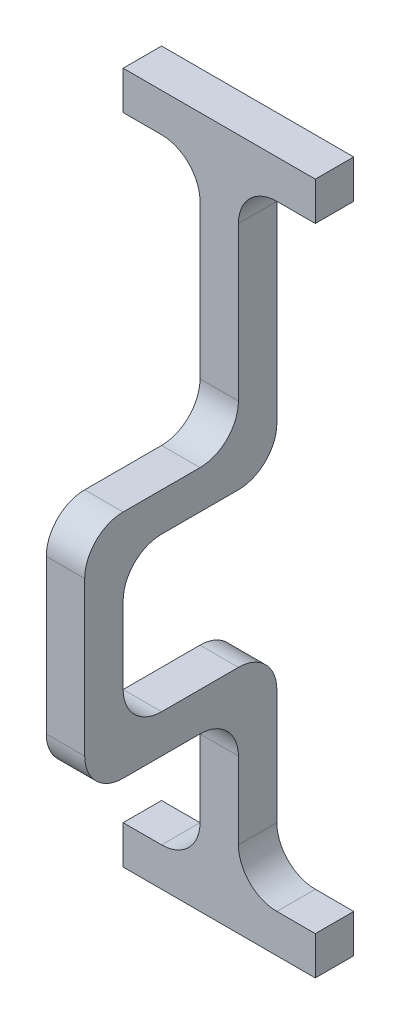
ISO-10303-21;
HEADER;
FILE_DESCRIPTION(('STEP AP214'),'2;1');
FILE_NAME('part.step','',(''),(''),'','','');
FILE_SCHEMA(('AUTOMOTIVE_DESIGN { 1 0 10303 214 1 1 1 1 }'));
ENDSEC;
DATA;
#1=APPLICATION_CONTEXT('core data for automotive mechanical design processes');
#2=APPLICATION_PROTOCOL_DEFINITION('international standard','automotive_design',2000,#1);
#3=PRODUCT_CONTEXT('',#1,'mechanical');
#4=PRODUCT('Part','Part','',(#3));
#5=PRODUCT_RELATED_PRODUCT_CATEGORY('part','',(#4));
#6=PRODUCT_DEFINITION_FORMATION('','',#4);
#7=PRODUCT_DEFINITION_CONTEXT('part definition',#1,'design');
#8=PRODUCT_DEFINITION('design','',#6,#7);
#9=PRODUCT_DEFINITION_SHAPE('','',#8);
#10=(LENGTH_UNIT() NAMED_UNIT(*) SI_UNIT(.MILLI.,.METRE.));
#11=(NAMED_UNIT(*) PLANE_ANGLE_UNIT() SI_UNIT($,.RADIAN.));
#12=(NAMED_UNIT(*) SI_UNIT($,.STERADIAN.) SOLID_ANGLE_UNIT());
#13=UNCERTAINTY_MEASURE_WITH_UNIT(LENGTH_MEASURE(1.E-05),#10,'distance_accuracy_value','');
#14=(GEOMETRIC_REPRESENTATION_CONTEXT(3) GLOBAL_UNCERTAINTY_ASSIGNED_CONTEXT((#13)) GLOBAL_UNIT_ASSIGNED_CONTEXT((#10,
#11,#12)) REPRESENTATION_CONTEXT('',''));
#15=CARTESIAN_POINT('',(0.,0.,0.));
#16=DIRECTION('',(0.,0.,1.));
#17=DIRECTION('',(1.,0.,0.));
#18=AXIS2_PLACEMENT_3D('',#15,#16,#17);
#19=CARTESIAN_POINT('',(10.,0.,0.));
#20=DIRECTION('',(1.,0.,0.));
#21=DIRECTION('',(0.,0.,-1.));
#22=AXIS2_PLACEMENT_3D('',#19,#20,#21);
#23=PLANE('',#22);
#24=DIRECTION('',(0.,-1.,0.));
#25=VECTOR('',#24,1.);
#26=CARTESIAN_POINT('',(10.,-50.,9.99999999999998));
#27=LINE('',#26,#25);
#28=CARTESIAN_POINT('',(10.,-60.,9.99999999999998));
#29=VERTEX_POINT('',#28);
#30=CARTESIAN_POINT('',(10.,-80.,9.99999999999998));
#31=VERTEX_POINT('',#30);
#32=EDGE_CURVE('E458',#29,#31,#27,.T.);
#33=ORIENTED_EDGE('',*,*,#32,.T.);
#34=DIRECTION('',(0.,0.,1.));
#35=VECTOR('',#34,1.);
#36=CARTESIAN_POINT('',(10.,-80.,0.));
#37=LINE('',#36,#35);
#38=CARTESIAN_POINT('',(10.,-80.,0.));
#39=VERTEX_POINT('',#38);
#40=EDGE_CURVE('E340',#31,#39,#37,.F.);
#41=ORIENTED_EDGE('',*,*,#40,.T.);
#42=DIRECTION('',(0.,1.,0.));
#43=VECTOR('',#42,1.);
#44=CARTESIAN_POINT('',(10.,-100.,0.));
#45=LINE('',#44,#43);
#46=CARTESIAN_POINT('',(10.,-50.,0.));
#47=VERTEX_POINT('',#46);
#48=EDGE_CURVE('E462',#39,#47,#45,.T.);
#49=ORIENTED_EDGE('',*,*,#48,.T.);
#50=CARTESIAN_POINT('',(10.,-50.,10.));
#51=DIRECTION('',(1.,0.,0.));
#52=DIRECTION('',(0.,0.,-1.));
#53=AXIS2_PLACEMENT_3D('',#50,#51,#52);
#54=CIRCLE('',#53,10.);
#55=CARTESIAN_POINT('',(10.,-40.,10.));
#56=VERTEX_POINT('',#55);
#57=EDGE_CURVE('E338',#47,#56,#54,.T.);
#58=ORIENTED_EDGE('',*,*,#57,.T.);
#59=DIRECTION('',(0.,0.,1.));
#60=VECTOR('',#59,1.);
#61=CARTESIAN_POINT('',(10.,-40.,0.));
#62=LINE('',#61,#60);
#63=CARTESIAN_POINT('',(10.,-40.,30.));
#64=VERTEX_POINT('',#63);
#65=EDGE_CURVE('E465',#56,#64,#62,.T.);
#66=ORIENTED_EDGE('',*,*,#65,.T.);
#67=CARTESIAN_POINT('',(10.,-30.,30.));
#68=DIRECTION('',(1.,0.,0.));
#69=DIRECTION('',(0.,0.,-1.));
#70=AXIS2_PLACEMENT_3D('',#67,#68,#69);
#71=CIRCLE('',#70,10.);
#72=CARTESIAN_POINT('',(10.,-30.,40.));
#73=VERTEX_POINT('',#72);
#74=EDGE_CURVE('E472',#64,#73,#71,.F.);
#75=ORIENTED_EDGE('',*,*,#74,.T.);
#76=DIRECTION('',(0.,1.,0.));
#77=VECTOR('',#76,1.);
#78=CARTESIAN_POINT('',(10.,-40.,40.));
#79=LINE('',#78,#77);
#80=CARTESIAN_POINT('',(10.,-10.,40.));
#81=VERTEX_POINT('',#80);
#82=EDGE_CURVE('E422',#73,#81,#79,.T.);
#83=ORIENTED_EDGE('',*,*,#82,.T.);
#84=CARTESIAN_POINT('',(10.,-10.,30.));
#85=DIRECTION('',(1.,0.,0.));
#86=DIRECTION('',(0.,0.,-1.));
#87=AXIS2_PLACEMENT_3D('',#84,#85,#86);
#88=CIRCLE('',#87,10.);
#89=CARTESIAN_POINT('',(10.,0.,30.));
#90=VERTEX_POINT('',#89);
#91=EDGE_CURVE('E11',#81,#90,#88,.F.);
#92=ORIENTED_EDGE('',*,*,#91,.T.);
#93=DIRECTION('',(0.,0.,-1.));
#94=VECTOR('',#93,1.);
#95=CARTESIAN_POINT('',(10.,0.,40.));
#96=LINE('',#95,#94);
#97=CARTESIAN_POINT('',(10.,0.,10.));
#98=VERTEX_POINT('',#97);
#99=EDGE_CURVE('E314',#90,#98,#96,.T.);
#100=ORIENTED_EDGE('',*,*,#99,.T.);
#101=CARTESIAN_POINT('',(10.,10.,10.));
#102=DIRECTION('',(1.,0.,0.));
#103=DIRECTION('',(0.,0.,-1.));
#104=AXIS2_PLACEMENT_3D('',#101,#102,#103);
#105=CIRCLE('',#104,10.);
#106=CARTESIAN_POINT('',(10.,10.,0.));
#107=VERTEX_POINT('',#106);
#108=EDGE_CURVE('E336',#98,#107,#105,.T.);
#109=ORIENTED_EDGE('',*,*,#108,.T.);
#110=DIRECTION('',(0.,1.,0.));
#111=VECTOR('',#110,1.);
#112=CARTESIAN_POINT('',(10.,0.,0.));
#113=LINE('',#112,#111);
#114=CARTESIAN_POINT('',(10.,60.,0.));
#115=VERTEX_POINT('',#114);
#116=EDGE_CURVE('E317',#107,#115,#113,.T.);
#117=ORIENTED_EDGE('',*,*,#116,.T.);
#118=DIRECTION('',(0.,0.,-1.));
#119=VECTOR('',#118,1.);
#120=CARTESIAN_POINT('',(10.,60.,0.));
#121=LINE('',#120,#119);
#122=CARTESIAN_POINT('',(10.,60.,10.));
#123=VERTEX_POINT('',#122);
#124=EDGE_CURVE('E334',#115,#123,#121,.F.);
#125=ORIENTED_EDGE('',*,*,#124,.T.);
#126=DIRECTION('',(0.,-1.,0.));
#127=VECTOR('',#126,1.);
#128=CARTESIAN_POINT('',(10.,80.,10.));
#129=LINE('',#128,#127);
#130=CARTESIAN_POINT('',(10.,20.,9.99999999999999));
#131=VERTEX_POINT('',#130);
#132=EDGE_CURVE('E327',#123,#131,#129,.T.);
#133=ORIENTED_EDGE('',*,*,#132,.T.);
#134=CARTESIAN_POINT('',(10.,20.,20.));
#135=DIRECTION('',(1.,0.,0.));
#136=DIRECTION('',(0.,0.,-1.));
#137=AXIS2_PLACEMENT_3D('',#134,#135,#136);
#138=CIRCLE('',#137,10.);
#139=CARTESIAN_POINT('',(10.,9.99999999999999,20.));
#140=VERTEX_POINT('',#139);
#141=EDGE_CURVE('E503',#131,#140,#138,.F.);
#142=ORIENTED_EDGE('',*,*,#141,.T.);
#143=DIRECTION('',(0.,0.,1.));
#144=VECTOR('',#143,1.);
#145=CARTESIAN_POINT('',(10.,9.99999999999999,9.99999999999999));
#146=LINE('',#145,#144);
#147=CARTESIAN_POINT('',(10.,9.99999999999999,40.));
#148=VERTEX_POINT('',#147);
#149=EDGE_CURVE('E374',#140,#148,#146,.T.);
#150=ORIENTED_EDGE('',*,*,#149,.T.);
#151=CARTESIAN_POINT('',(10.,0.,40.));
#152=DIRECTION('',(1.,0.,0.));
#153=DIRECTION('',(0.,0.,-1.));
#154=AXIS2_PLACEMENT_3D('',#151,#152,#153);
#155=CIRCLE('',#154,10.);
#156=CARTESIAN_POINT('',(10.,0.,50.));
#157=VERTEX_POINT('',#156);
#158=EDGE_CURVE('E330',#148,#157,#155,.T.);
#159=ORIENTED_EDGE('',*,*,#158,.T.);
#160=DIRECTION('',(0.,-1.,0.));
#161=VECTOR('',#160,1.);
#162=CARTESIAN_POINT('',(10.,9.99999999999999,50.));
#163=LINE('',#162,#161);
#164=CARTESIAN_POINT('',(10.,-40.,50.));
#165=VERTEX_POINT('',#164);
#166=EDGE_CURVE('E451',#157,#165,#163,.T.);
#167=ORIENTED_EDGE('',*,*,#166,.T.);
#168=CARTESIAN_POINT('',(10.,-40.,40.));
#169=DIRECTION('',(1.,0.,0.));
#170=DIRECTION('',(0.,0.,-1.));
#171=AXIS2_PLACEMENT_3D('',#168,#169,#170);
#172=CIRCLE('',#171,10.);
#173=CARTESIAN_POINT('',(10.,-50.,40.));
#174=VERTEX_POINT('',#173);
#175=EDGE_CURVE('E332',#165,#174,#172,.T.);
#176=ORIENTED_EDGE('',*,*,#175,.T.);
#177=DIRECTION('',(0.,0.,-1.));
#178=VECTOR('',#177,1.);
#179=CARTESIAN_POINT('',(10.,-50.,50.));
#180=LINE('',#179,#178);
#181=CARTESIAN_POINT('',(10.,-50.,20.));
#182=VERTEX_POINT('',#181);
#183=EDGE_CURVE('E455',#174,#182,#180,.T.);
#184=ORIENTED_EDGE('',*,*,#183,.T.);
#185=CARTESIAN_POINT('',(10.,-60.,20.));
#186=DIRECTION('',(1.,0.,0.));
#187=DIRECTION('',(0.,0.,-1.));
#188=AXIS2_PLACEMENT_3D('',#185,#186,#187);
#189=CIRCLE('',#188,10.);
#190=EDGE_CURVE('E499',#182,#29,#189,.F.);
#191=ORIENTED_EDGE('',*,*,#190,.T.);
#192=EDGE_LOOP('',(#33,#41,#49,#58,#66,#75,#83,#92,#100,#109,#117,#125,#133,#142,#150,#159,#167,
#176,#184,#191));
#193=FACE_BOUND('',#192,.T.);
#194=ADVANCED_FACE('F33',(#193),#23,.T.);
#195=CARTESIAN_POINT('',(10.,0.,40.));
#196=DIRECTION('',(0.,1.,0.));
#197=DIRECTION('',(0.,0.,1.));
#198=AXIS2_PLACEMENT_3D('',#195,#196,#197);
#199=PLANE('',#198);
#200=DIRECTION('',(0.,0.,-1.));
#201=VECTOR('',#200,1.);
#202=CARTESIAN_POINT('',(0.,0.,40.));
#203=LINE('',#202,#201);
#204=CARTESIAN_POINT('',(0.,0.,30.));
#205=VERTEX_POINT('',#204);
#206=CARTESIAN_POINT('',(0.,0.,10.));
#207=VERTEX_POINT('',#206);
#208=EDGE_CURVE('E357',#205,#207,#203,.T.);
#209=ORIENTED_EDGE('',*,*,#208,.T.);
#210=DIRECTION('',(-1.,0.,0.));
#211=VECTOR('',#210,1.);
#212=CARTESIAN_POINT('',(10.,0.,10.));
#213=LINE('',#212,#211);
#214=EDGE_CURVE('E484',#207,#98,#213,.F.);
#215=ORIENTED_EDGE('',*,*,#214,.T.);
#216=ORIENTED_EDGE('',*,*,#99,.F.);
#217=DIRECTION('',(-1.,0.,0.));
#218=VECTOR('',#217,1.);
#219=CARTESIAN_POINT('',(0.,0.,30.));
#220=LINE('',#219,#218);
#221=EDGE_CURVE('E480',#90,#205,#220,.T.);
#222=ORIENTED_EDGE('',*,*,#221,.T.);
#223=EDGE_LOOP('',(#209,#215,#216,#222));
#224=FACE_BOUND('',#223,.T.);
#225=ADVANCED_FACE('F594',(#224),#199,.F.);
#226=CARTESIAN_POINT('',(10.,0.,0.));
#227=DIRECTION('',(0.,0.,1.));
#228=DIRECTION('',(1.,0.,0.));
#229=AXIS2_PLACEMENT_3D('',#226,#227,#228);
#230=PLANE('',#229);
#231=ORIENTED_EDGE('',*,*,#116,.F.);
#232=DIRECTION('',(-1.,0.,0.));
#233=VECTOR('',#232,1.);
#234=CARTESIAN_POINT('',(10.,10.,0.));
#235=LINE('',#234,#233);
#236=CARTESIAN_POINT('',(0.,10.,0.));
#237=VERTEX_POINT('',#236);
#238=EDGE_CURVE('E485',#107,#237,#235,.T.);
#239=ORIENTED_EDGE('',*,*,#238,.T.);
#240=DIRECTION('',(0.,1.,0.));
#241=VECTOR('',#240,1.);
#242=CARTESIAN_POINT('',(0.,0.,0.));
#243=LINE('',#242,#241);
#244=CARTESIAN_POINT('',(0.,60.,0.));
#245=VERTEX_POINT('',#244);
#246=EDGE_CURVE('E353',#237,#245,#243,.T.);
#247=ORIENTED_EDGE('',*,*,#246,.T.);
#248=CARTESIAN_POINT('',(-10.,60.,0.));
#249=DIRECTION('',(0.,0.,1.));
#250=DIRECTION('',(1.,0.,0.));
#251=AXIS2_PLACEMENT_3D('',#248,#249,#250);
#252=CIRCLE('',#251,10.);
#253=CARTESIAN_POINT('',(-10.,70.,0.));
#254=VERTEX_POINT('',#253);
#255=EDGE_CURVE('E56',#245,#254,#252,.T.);
#256=ORIENTED_EDGE('',*,*,#255,.T.);
#257=DIRECTION('',(1.,0.,0.));
#258=VECTOR('',#257,1.);
#259=CARTESIAN_POINT('',(-20.,70.,0.));
#260=LINE('',#259,#258);
#261=CARTESIAN_POINT('',(-20.,70.,0.));
#262=VERTEX_POINT('',#261);
#263=EDGE_CURVE('E289',#262,#254,#260,.T.);
#264=ORIENTED_EDGE('',*,*,#263,.F.);
#265=DIRECTION('',(0.,1.,0.));
#266=VECTOR('',#265,1.);
#267=CARTESIAN_POINT('',(-20.,80.,0.));
#268=LINE('',#267,#266);
#269=CARTESIAN_POINT('',(-20.,80.,0.));
#270=VERTEX_POINT('',#269);
#271=EDGE_CURVE('E278',#262,#270,#268,.T.);
#272=ORIENTED_EDGE('',*,*,#271,.T.);
#273=DIRECTION('',(-1.,0.,0.));
#274=VECTOR('',#273,1.);
#275=CARTESIAN_POINT('',(10.,80.,0.));
#276=LINE('',#275,#274);
#277=CARTESIAN_POINT('',(30.,80.,0.));
#278=VERTEX_POINT('',#277);
#279=EDGE_CURVE('E398',#278,#270,#276,.T.);
#280=ORIENTED_EDGE('',*,*,#279,.F.);
#281=DIRECTION('',(0.,1.,0.));
#282=VECTOR('',#281,1.);
#283=CARTESIAN_POINT('',(30.,80.,0.));
#284=LINE('',#283,#282);
#285=CARTESIAN_POINT('',(30.,70.,0.));
#286=VERTEX_POINT('',#285);
#287=EDGE_CURVE('E307',#286,#278,#284,.T.);
#288=ORIENTED_EDGE('',*,*,#287,.F.);
#289=DIRECTION('',(-1.,0.,0.));
#290=VECTOR('',#289,1.);
#291=CARTESIAN_POINT('',(30.,70.,0.));
#292=LINE('',#291,#290);
#293=CARTESIAN_POINT('',(20.,70.,0.));
#294=VERTEX_POINT('',#293);
#295=EDGE_CURVE('E313',#286,#294,#292,.T.);
#296=ORIENTED_EDGE('',*,*,#295,.T.);
#297=CARTESIAN_POINT('',(20.,60.,0.));
#298=DIRECTION('',(0.,0.,1.));
#299=DIRECTION('',(1.,0.,0.));
#300=AXIS2_PLACEMENT_3D('',#297,#298,#299);
#301=CIRCLE('',#300,10.);
#302=EDGE_CURVE('E48',#294,#115,#301,.T.);
#303=ORIENTED_EDGE('',*,*,#302,.T.);
#304=EDGE_LOOP('',(#231,#239,#247,#256,#264,#272,#280,#288,#296,#303));
#305=FACE_BOUND('',#304,.T.);
#306=ADVANCED_FACE('F599',(#305),#230,.F.);
#307=CARTESIAN_POINT('',(10.,80.,0.));
#308=DIRECTION('',(0.,-1.,0.));
#309=DIRECTION('',(0.,0.,-1.));
#310=AXIS2_PLACEMENT_3D('',#307,#308,#309);
#311=PLANE('',#310);
#312=ORIENTED_EDGE('',*,*,#279,.T.);
#313=DIRECTION('',(0.,0.,1.));
#314=VECTOR('',#313,1.);
#315=CARTESIAN_POINT('',(-20.,80.,10.));
#316=LINE('',#315,#314);
#317=CARTESIAN_POINT('',(-20.,80.,10.));
#318=VERTEX_POINT('',#317);
#319=EDGE_CURVE('E275',#270,#318,#316,.T.);
#320=ORIENTED_EDGE('',*,*,#319,.T.);
#321=DIRECTION('',(-1.,0.,0.));
#322=VECTOR('',#321,1.);
#323=CARTESIAN_POINT('',(10.,80.,10.));
#324=LINE('',#323,#322);
#325=CARTESIAN_POINT('',(30.,80.,10.));
#326=VERTEX_POINT('',#325);
#327=EDGE_CURVE('E416',#326,#318,#324,.T.);
#328=ORIENTED_EDGE('',*,*,#327,.F.);
#329=DIRECTION('',(0.,0.,1.));
#330=VECTOR('',#329,1.);
#331=CARTESIAN_POINT('',(30.,80.,10.));
#332=LINE('',#331,#330);
#333=EDGE_CURVE('E310',#278,#326,#332,.T.);
#334=ORIENTED_EDGE('',*,*,#333,.F.);
#335=EDGE_LOOP('',(#312,#320,#328,#334));
#336=FACE_BOUND('',#335,.T.);
#337=ADVANCED_FACE('F626',(#336),#311,.F.);
#338=CARTESIAN_POINT('',(10.,80.,10.));
#339=DIRECTION('',(0.,0.,-1.));
#340=DIRECTION('',(0.,1.,0.));
#341=AXIS2_PLACEMENT_3D('',#338,#339,#340);
#342=PLANE('',#341);
#343=DIRECTION('',(0.,-1.,0.));
#344=VECTOR('',#343,1.);
#345=CARTESIAN_POINT('',(0.,80.,10.));
#346=LINE('',#345,#344);
#347=CARTESIAN_POINT('',(0.,60.,10.));
#348=VERTEX_POINT('',#347);
#349=CARTESIAN_POINT('',(0.,20.,9.99999999999999));
#350=VERTEX_POINT('',#349);
#351=EDGE_CURVE('E356',#348,#350,#346,.T.);
#352=ORIENTED_EDGE('',*,*,#351,.T.);
#353=DIRECTION('',(-1.,0.,0.));
#354=VECTOR('',#353,1.);
#355=CARTESIAN_POINT('',(10.,20.,9.99999999999999));
#356=LINE('',#355,#354);
#357=EDGE_CURVE('E375',#350,#131,#356,.F.);
#358=ORIENTED_EDGE('',*,*,#357,.T.);
#359=ORIENTED_EDGE('',*,*,#132,.F.);
#360=CARTESIAN_POINT('',(20.,60.,10.));
#361=DIRECTION('',(0.,0.,-1.));
#362=DIRECTION('',(0.,1.,0.));
#363=AXIS2_PLACEMENT_3D('',#360,#361,#362);
#364=CIRCLE('',#363,10.);
#365=CARTESIAN_POINT('',(20.,70.,10.));
#366=VERTEX_POINT('',#365);
#367=EDGE_CURVE('E519',#123,#366,#364,.T.);
#368=ORIENTED_EDGE('',*,*,#367,.T.);
#369=DIRECTION('',(-1.,0.,0.));
#370=VECTOR('',#369,1.);
#371=CARTESIAN_POINT('',(30.,70.,10.));
#372=LINE('',#371,#370);
#373=CARTESIAN_POINT('',(30.,70.,10.));
#374=VERTEX_POINT('',#373);
#375=EDGE_CURVE('E408',#374,#366,#372,.T.);
#376=ORIENTED_EDGE('',*,*,#375,.F.);
#377=DIRECTION('',(0.,-1.,0.));
#378=VECTOR('',#377,1.);
#379=CARTESIAN_POINT('',(30.,80.,10.));
#380=LINE('',#379,#378);
#381=EDGE_CURVE('E302',#326,#374,#380,.T.);
#382=ORIENTED_EDGE('',*,*,#381,.F.);
#383=ORIENTED_EDGE('',*,*,#327,.T.);
#384=DIRECTION('',(0.,-1.,0.));
#385=VECTOR('',#384,1.);
#386=CARTESIAN_POINT('',(-20.,80.,10.));
#387=LINE('',#386,#385);
#388=CARTESIAN_POINT('',(-20.,70.,10.));
#389=VERTEX_POINT('',#388);
#390=EDGE_CURVE('E253',#318,#389,#387,.T.);
#391=ORIENTED_EDGE('',*,*,#390,.T.);
#392=DIRECTION('',(1.,0.,0.));
#393=VECTOR('',#392,1.);
#394=CARTESIAN_POINT('',(-20.,70.,10.));
#395=LINE('',#394,#393);
#396=CARTESIAN_POINT('',(-10.,70.,10.));
#397=VERTEX_POINT('',#396);
#398=EDGE_CURVE('E284',#389,#397,#395,.T.);
#399=ORIENTED_EDGE('',*,*,#398,.T.);
#400=CARTESIAN_POINT('',(-10.,60.,10.));
#401=DIRECTION('',(0.,0.,-1.));
#402=DIRECTION('',(0.,1.,0.));
#403=AXIS2_PLACEMENT_3D('',#400,#401,#402);
#404=CIRCLE('',#403,10.);
#405=EDGE_CURVE('E516',#397,#348,#404,.T.);
#406=ORIENTED_EDGE('',*,*,#405,.T.);
#407=EDGE_LOOP('',(#352,#358,#359,#368,#376,#382,#383,#391,#399,#406));
#408=FACE_BOUND('',#407,.T.);
#409=ADVANCED_FACE('F623',(#408),#342,.F.);
#410=CARTESIAN_POINT('',(10.,9.99999999999999,9.99999999999999));
#411=DIRECTION('',(0.,-1.,0.));
#412=DIRECTION('',(0.,0.,-1.));
#413=AXIS2_PLACEMENT_3D('',#410,#411,#412);
#414=PLANE('',#413);
#415=ORIENTED_EDGE('',*,*,#149,.F.);
#416=DIRECTION('',(-1.,0.,0.));
#417=VECTOR('',#416,1.);
#418=CARTESIAN_POINT('',(0.,9.99999999999999,20.));
#419=LINE('',#418,#417);
#420=CARTESIAN_POINT('',(0.,9.99999999999999,20.));
#421=VERTEX_POINT('',#420);
#422=EDGE_CURVE('E371',#140,#421,#419,.T.);
#423=ORIENTED_EDGE('',*,*,#422,.T.);
#424=DIRECTION('',(0.,0.,1.));
#425=VECTOR('',#424,1.);
#426=CARTESIAN_POINT('',(0.,9.99999999999999,9.99999999999999));
#427=LINE('',#426,#425);
#428=CARTESIAN_POINT('',(0.,9.99999999999999,40.));
#429=VERTEX_POINT('',#428);
#430=EDGE_CURVE('E365',#421,#429,#427,.T.);
#431=ORIENTED_EDGE('',*,*,#430,.T.);
#432=DIRECTION('',(-1.,0.,0.));
#433=VECTOR('',#432,1.);
#434=CARTESIAN_POINT('',(10.,9.99999999999999,40.));
#435=LINE('',#434,#433);
#436=EDGE_CURVE('E381',#429,#148,#435,.F.);
#437=ORIENTED_EDGE('',*,*,#436,.T.);
#438=EDGE_LOOP('',(#415,#423,#431,#437));
#439=FACE_BOUND('',#438,.T.);
#440=ADVANCED_FACE('F441',(#439),#414,.F.);
#441=CARTESIAN_POINT('',(10.,9.99999999999999,50.));
#442=DIRECTION('',(0.,0.,-1.));
#443=DIRECTION('',(0.,1.,0.));
#444=AXIS2_PLACEMENT_3D('',#441,#442,#443);
#445=PLANE('',#444);
#446=DIRECTION('',(0.,-1.,0.));
#447=VECTOR('',#446,1.);
#448=CARTESIAN_POINT('',(0.,9.99999999999999,50.));
#449=LINE('',#448,#447);
#450=CARTESIAN_POINT('',(0.,0.,50.));
#451=VERTEX_POINT('',#450);
#452=CARTESIAN_POINT('',(0.,-40.,50.));
#453=VERTEX_POINT('',#452);
#454=EDGE_CURVE('E435',#451,#453,#449,.T.);
#455=ORIENTED_EDGE('',*,*,#454,.T.);
#456=DIRECTION('',(-1.,0.,0.));
#457=VECTOR('',#456,1.);
#458=CARTESIAN_POINT('',(10.,-40.,50.));
#459=LINE('',#458,#457);
#460=EDGE_CURVE('E454',#453,#165,#459,.F.);
#461=ORIENTED_EDGE('',*,*,#460,.T.);
#462=ORIENTED_EDGE('',*,*,#166,.F.);
#463=DIRECTION('',(-1.,0.,0.));
#464=VECTOR('',#463,1.);
#465=CARTESIAN_POINT('',(10.,0.,50.));
#466=LINE('',#465,#464);
#467=EDGE_CURVE('E446',#157,#451,#466,.T.);
#468=ORIENTED_EDGE('',*,*,#467,.T.);
#469=EDGE_LOOP('',(#455,#461,#462,#468));
#470=FACE_BOUND('',#469,.T.);
#471=ADVANCED_FACE('F453',(#470),#445,.F.);
#472=CARTESIAN_POINT('',(10.,-50.,50.));
#473=DIRECTION('',(0.,1.,0.));
#474=DIRECTION('',(0.,0.,1.));
#475=AXIS2_PLACEMENT_3D('',#472,#473,#474);
#476=PLANE('',#475);
#477=DIRECTION('',(0.,0.,-1.));
#478=VECTOR('',#477,1.);
#479=CARTESIAN_POINT('',(0.,-50.,50.));
#480=LINE('',#479,#478);
#481=CARTESIAN_POINT('',(0.,-50.,40.));
#482=VERTEX_POINT('',#481);
#483=CARTESIAN_POINT('',(0.,-50.,20.));
#484=VERTEX_POINT('',#483);
#485=EDGE_CURVE('E433',#482,#484,#480,.T.);
#486=ORIENTED_EDGE('',*,*,#485,.T.);
#487=DIRECTION('',(-1.,0.,0.));
#488=VECTOR('',#487,1.);
#489=CARTESIAN_POINT('',(10.,-50.,20.));
#490=LINE('',#489,#488);
#491=EDGE_CURVE('E387',#484,#182,#490,.F.);
#492=ORIENTED_EDGE('',*,*,#491,.T.);
#493=ORIENTED_EDGE('',*,*,#183,.F.);
#494=DIRECTION('',(-1.,0.,0.));
#495=VECTOR('',#494,1.);
#496=CARTESIAN_POINT('',(10.,-50.,40.));
#497=LINE('',#496,#495);
#498=EDGE_CURVE('E390',#174,#482,#497,.T.);
#499=ORIENTED_EDGE('',*,*,#498,.T.);
#500=EDGE_LOOP('',(#486,#492,#493,#499));
#501=FACE_BOUND('',#500,.T.);
#502=ADVANCED_FACE('F579',(#501),#476,.F.);
#503=CARTESIAN_POINT('',(10.,-50.,9.99999999999998));
#504=DIRECTION('',(0.,0.,-1.));
#505=DIRECTION('',(0.,1.,0.));
#506=AXIS2_PLACEMENT_3D('',#503,#504,#505);
#507=PLANE('',#506);
#508=ORIENTED_EDGE('',*,*,#32,.F.);
#509=DIRECTION('',(-1.,0.,0.));
#510=VECTOR('',#509,1.);
#511=CARTESIAN_POINT('',(0.,-60.,9.99999999999998));
#512=LINE('',#511,#510);
#513=CARTESIAN_POINT('',(0.,-60.,9.99999999999998));
#514=VERTEX_POINT('',#513);
#515=EDGE_CURVE('E395',#29,#514,#512,.T.);
#516=ORIENTED_EDGE('',*,*,#515,.T.);
#517=DIRECTION('',(0.,-1.,0.));
#518=VECTOR('',#517,1.);
#519=CARTESIAN_POINT('',(0.,-50.,9.99999999999998));
#520=LINE('',#519,#518);
#521=CARTESIAN_POINT('',(0.,-80.,9.99999999999998));
#522=VERTEX_POINT('',#521);
#523=EDGE_CURVE('E431',#514,#522,#520,.T.);
#524=ORIENTED_EDGE('',*,*,#523,.T.);
#525=CARTESIAN_POINT('',(-10.,-80.,9.99999999999998));
#526=DIRECTION('',(0.,0.,-1.));
#527=DIRECTION('',(0.,1.,0.));
#528=AXIS2_PLACEMENT_3D('',#525,#526,#527);
#529=CIRCLE('',#528,10.);
#530=CARTESIAN_POINT('',(-10.,-90.,9.99999999999998));
#531=VERTEX_POINT('',#530);
#532=EDGE_CURVE('E249',#522,#531,#529,.T.);
#533=ORIENTED_EDGE('',*,*,#532,.T.);
#534=DIRECTION('',(1.,0.,0.));
#535=VECTOR('',#534,1.);
#536=CARTESIAN_POINT('',(-20.,-90.,9.99999999999998));
#537=LINE('',#536,#535);
#538=CARTESIAN_POINT('',(-20.,-90.,9.99999999999998));
#539=VERTEX_POINT('',#538);
#540=EDGE_CURVE('E242',#539,#531,#537,.T.);
#541=ORIENTED_EDGE('',*,*,#540,.F.);
#542=DIRECTION('',(0.,-1.,0.));
#543=VECTOR('',#542,1.);
#544=CARTESIAN_POINT('',(-20.,-100.,9.99999999999998));
#545=LINE('',#544,#543);
#546=CARTESIAN_POINT('',(-20.,-100.,9.99999999999998));
#547=VERTEX_POINT('',#546);
#548=EDGE_CURVE('E246',#539,#547,#545,.T.);
#549=ORIENTED_EDGE('',*,*,#548,.T.);
#550=DIRECTION('',(-1.,0.,0.));
#551=VECTOR('',#550,1.);
#552=CARTESIAN_POINT('',(10.,-100.,9.99999999999998));
#553=LINE('',#552,#551);
#554=CARTESIAN_POINT('',(30.,-100.,9.99999999999998));
#555=VERTEX_POINT('',#554);
#556=EDGE_CURVE('E418',#555,#547,#553,.T.);
#557=ORIENTED_EDGE('',*,*,#556,.F.);
#558=DIRECTION('',(0.,-1.,0.));
#559=VECTOR('',#558,1.);
#560=CARTESIAN_POINT('',(30.,-100.,9.99999999999998));
#561=LINE('',#560,#559);
#562=CARTESIAN_POINT('',(30.,-90.,9.99999999999998));
#563=VERTEX_POINT('',#562);
#564=EDGE_CURVE('E285',#563,#555,#561,.T.);
#565=ORIENTED_EDGE('',*,*,#564,.F.);
#566=DIRECTION('',(-1.,0.,0.));
#567=VECTOR('',#566,1.);
#568=CARTESIAN_POINT('',(30.,-90.,9.99999999999998));
#569=LINE('',#568,#567);
#570=CARTESIAN_POINT('',(20.,-90.,9.99999999999998));
#571=VERTEX_POINT('',#570);
#572=EDGE_CURVE('E296',#563,#571,#569,.T.);
#573=ORIENTED_EDGE('',*,*,#572,.T.);
#574=CARTESIAN_POINT('',(20.,-80.,9.99999999999998));
#575=DIRECTION('',(0.,0.,-1.));
#576=DIRECTION('',(0.,1.,0.));
#577=AXIS2_PLACEMENT_3D('',#574,#575,#576);
#578=CIRCLE('',#577,10.);
#579=EDGE_CURVE('E505',#571,#31,#578,.T.);
#580=ORIENTED_EDGE('',*,*,#579,.T.);
#581=EDGE_LOOP('',(#508,#516,#524,#533,#541,#549,#557,#565,#573,#580));
#582=FACE_BOUND('',#581,.T.);
#583=ADVANCED_FACE('F245',(#582),#507,.F.);
#584=CARTESIAN_POINT('',(10.,-100.,9.99999999999998));
#585=DIRECTION('',(0.,1.,0.));
#586=DIRECTION('',(0.,0.,1.));
#587=AXIS2_PLACEMENT_3D('',#584,#585,#586);
#588=PLANE('',#587);
#589=ORIENTED_EDGE('',*,*,#556,.T.);
#590=DIRECTION('',(0.,0.,-1.));
#591=VECTOR('',#590,1.);
#592=CARTESIAN_POINT('',(-20.,-100.,9.99999999999998));
#593=LINE('',#592,#591);
#594=CARTESIAN_POINT('',(-20.,-100.,0.));
#595=VERTEX_POINT('',#594);
#596=EDGE_CURVE('E263',#547,#595,#593,.T.);
#597=ORIENTED_EDGE('',*,*,#596,.T.);
#598=DIRECTION('',(-1.,0.,0.));
#599=VECTOR('',#598,1.);
#600=CARTESIAN_POINT('',(10.,-100.,0.));
#601=LINE('',#600,#599);
#602=CARTESIAN_POINT('',(30.,-100.,0.));
#603=VERTEX_POINT('',#602);
#604=EDGE_CURVE('E420',#603,#595,#601,.T.);
#605=ORIENTED_EDGE('',*,*,#604,.F.);
#606=DIRECTION('',(0.,0.,-1.));
#607=VECTOR('',#606,1.);
#608=CARTESIAN_POINT('',(30.,-100.,9.99999999999998));
#609=LINE('',#608,#607);
#610=EDGE_CURVE('E288',#555,#603,#609,.T.);
#611=ORIENTED_EDGE('',*,*,#610,.F.);
#612=EDGE_LOOP('',(#589,#597,#605,#611));
#613=FACE_BOUND('',#612,.T.);
#614=ADVANCED_FACE('F570',(#613),#588,.F.);
#615=CARTESIAN_POINT('',(10.,-100.,0.));
#616=DIRECTION('',(0.,0.,1.));
#617=DIRECTION('',(1.,0.,0.));
#618=AXIS2_PLACEMENT_3D('',#615,#616,#617);
#619=PLANE('',#618);
#620=DIRECTION('',(0.,1.,0.));
#621=VECTOR('',#620,1.);
#622=CARTESIAN_POINT('',(0.,-100.,0.));
#623=LINE('',#622,#621);
#624=CARTESIAN_POINT('',(0.,-80.,0.));
#625=VERTEX_POINT('',#624);
#626=CARTESIAN_POINT('',(0.,-50.,0.));
#627=VERTEX_POINT('',#626);
#628=EDGE_CURVE('E428',#625,#627,#623,.T.);
#629=ORIENTED_EDGE('',*,*,#628,.T.);
#630=DIRECTION('',(-1.,0.,0.));
#631=VECTOR('',#630,1.);
#632=CARTESIAN_POINT('',(10.,-50.,0.));
#633=LINE('',#632,#631);
#634=EDGE_CURVE('E490',#627,#47,#633,.F.);
#635=ORIENTED_EDGE('',*,*,#634,.T.);
#636=ORIENTED_EDGE('',*,*,#48,.F.);
#637=CARTESIAN_POINT('',(20.,-80.,0.));
#638=DIRECTION('',(0.,0.,1.));
#639=DIRECTION('',(1.,0.,0.));
#640=AXIS2_PLACEMENT_3D('',#637,#638,#639);
#641=CIRCLE('',#640,10.);
#642=CARTESIAN_POINT('',(20.,-90.,0.));
#643=VERTEX_POINT('',#642);
#644=EDGE_CURVE('E507',#39,#643,#641,.T.);
#645=ORIENTED_EDGE('',*,*,#644,.T.);
#646=DIRECTION('',(-1.,0.,0.));
#647=VECTOR('',#646,1.);
#648=CARTESIAN_POINT('',(30.,-90.,0.));
#649=LINE('',#648,#647);
#650=CARTESIAN_POINT('',(30.,-90.,0.));
#651=VERTEX_POINT('',#650);
#652=EDGE_CURVE('E299',#651,#643,#649,.T.);
#653=ORIENTED_EDGE('',*,*,#652,.F.);
#654=DIRECTION('',(0.,1.,0.));
#655=VECTOR('',#654,1.);
#656=CARTESIAN_POINT('',(30.,-100.,0.));
#657=LINE('',#656,#655);
#658=EDGE_CURVE('E292',#603,#651,#657,.T.);
#659=ORIENTED_EDGE('',*,*,#658,.F.);
#660=ORIENTED_EDGE('',*,*,#604,.T.);
#661=DIRECTION('',(0.,1.,0.));
#662=VECTOR('',#661,1.);
#663=CARTESIAN_POINT('',(-20.,-100.,0.));
#664=LINE('',#663,#662);
#665=CARTESIAN_POINT('',(-20.,-90.,0.));
#666=VERTEX_POINT('',#665);
#667=EDGE_CURVE('E267',#595,#666,#664,.T.);
#668=ORIENTED_EDGE('',*,*,#667,.T.);
#669=DIRECTION('',(1.,0.,0.));
#670=VECTOR('',#669,1.);
#671=CARTESIAN_POINT('',(-20.,-90.,0.));
#672=LINE('',#671,#670);
#673=CARTESIAN_POINT('',(-10.,-90.,0.));
#674=VERTEX_POINT('',#673);
#675=EDGE_CURVE('E254',#666,#674,#672,.T.);
#676=ORIENTED_EDGE('',*,*,#675,.T.);
#677=CARTESIAN_POINT('',(-10.,-80.,0.));
#678=DIRECTION('',(0.,0.,1.));
#679=DIRECTION('',(1.,0.,0.));
#680=AXIS2_PLACEMENT_3D('',#677,#678,#679);
#681=CIRCLE('',#680,10.);
#682=EDGE_CURVE('E513',#674,#625,#681,.T.);
#683=ORIENTED_EDGE('',*,*,#682,.T.);
#684=EDGE_LOOP('',(#629,#635,#636,#645,#653,#659,#660,#668,#676,#683));
#685=FACE_BOUND('',#684,.T.);
#686=ADVANCED_FACE('F553',(#685),#619,.F.);
#687=CARTESIAN_POINT('',(10.,-40.,0.));
#688=DIRECTION('',(0.,-1.,0.));
#689=DIRECTION('',(0.,0.,-1.));
#690=AXIS2_PLACEMENT_3D('',#687,#688,#689);
#691=PLANE('',#690);
#692=DIRECTION('',(0.,0.,1.));
#693=VECTOR('',#692,1.);
#694=CARTESIAN_POINT('',(0.,-40.,0.));
#695=LINE('',#694,#693);
#696=CARTESIAN_POINT('',(0.,-40.,10.));
#697=VERTEX_POINT('',#696);
#698=CARTESIAN_POINT('',(0.,-40.,30.));
#699=VERTEX_POINT('',#698);
#700=EDGE_CURVE('E425',#697,#699,#695,.T.);
#701=ORIENTED_EDGE('',*,*,#700,.T.);
#702=DIRECTION('',(-1.,0.,0.));
#703=VECTOR('',#702,1.);
#704=CARTESIAN_POINT('',(10.,-40.,30.));
#705=LINE('',#704,#703);
#706=EDGE_CURVE('E350',#699,#64,#705,.F.);
#707=ORIENTED_EDGE('',*,*,#706,.T.);
#708=ORIENTED_EDGE('',*,*,#65,.F.);
#709=DIRECTION('',(-1.,0.,0.));
#710=VECTOR('',#709,1.);
#711=CARTESIAN_POINT('',(10.,-40.,10.));
#712=LINE('',#711,#710);
#713=EDGE_CURVE('E347',#56,#697,#712,.T.);
#714=ORIENTED_EDGE('',*,*,#713,.T.);
#715=EDGE_LOOP('',(#701,#707,#708,#714));
#716=FACE_BOUND('',#715,.T.);
#717=ADVANCED_FACE('F529',(#716),#691,.F.);
#718=CARTESIAN_POINT('',(10.,-40.,40.));
#719=DIRECTION('',(0.,0.,1.));
#720=DIRECTION('',(1.,0.,0.));
#721=AXIS2_PLACEMENT_3D('',#718,#719,#720);
#722=PLANE('',#721);
#723=ORIENTED_EDGE('',*,*,#82,.F.);
#724=DIRECTION('',(-1.,0.,0.));
#725=VECTOR('',#724,1.);
#726=CARTESIAN_POINT('',(0.,-30.,40.));
#727=LINE('',#726,#725);
#728=CARTESIAN_POINT('',(0.,-30.,40.));
#729=VERTEX_POINT('',#728);
#730=EDGE_CURVE('E344',#73,#729,#727,.T.);
#731=ORIENTED_EDGE('',*,*,#730,.T.);
#732=DIRECTION('',(0.,1.,0.));
#733=VECTOR('',#732,1.);
#734=CARTESIAN_POINT('',(0.,-40.,40.));
#735=LINE('',#734,#733);
#736=CARTESIAN_POINT('',(0.,-10.,40.));
#737=VERTEX_POINT('',#736);
#738=EDGE_CURVE('E318',#729,#737,#735,.T.);
#739=ORIENTED_EDGE('',*,*,#738,.T.);
#740=DIRECTION('',(-1.,0.,0.));
#741=VECTOR('',#740,1.);
#742=CARTESIAN_POINT('',(10.,-10.,40.));
#743=LINE('',#742,#741);
#744=EDGE_CURVE('E342',#737,#81,#743,.F.);
#745=ORIENTED_EDGE('',*,*,#744,.T.);
#746=EDGE_LOOP('',(#723,#731,#739,#745));
#747=FACE_BOUND('',#746,.T.);
#748=ADVANCED_FACE('F523',(#747),#722,.F.);
#749=CARTESIAN_POINT('',(0.,0.,0.));
#750=DIRECTION('',(1.,0.,0.));
#751=DIRECTION('',(0.,0.,-1.));
#752=AXIS2_PLACEMENT_3D('',#749,#750,#751);
#753=PLANE('',#752);
#754=ORIENTED_EDGE('',*,*,#628,.F.);
#755=DIRECTION('',(0.,0.,1.));
#756=VECTOR('',#755,1.);
#757=CARTESIAN_POINT('',(0.,-80.,0.));
#758=LINE('',#757,#756);
#759=EDGE_CURVE('E541',#625,#522,#758,.T.);
#760=ORIENTED_EDGE('',*,*,#759,.T.);
#761=ORIENTED_EDGE('',*,*,#523,.F.);
#762=CARTESIAN_POINT('',(0.,-60.,20.));
#763=DIRECTION('',(1.,0.,0.));
#764=DIRECTION('',(0.,0.,-1.));
#765=AXIS2_PLACEMENT_3D('',#762,#763,#764);
#766=CIRCLE('',#765,10.);
#767=EDGE_CURVE('E497',#514,#484,#766,.T.);
#768=ORIENTED_EDGE('',*,*,#767,.T.);
#769=ORIENTED_EDGE('',*,*,#485,.F.);
#770=CARTESIAN_POINT('',(0.,-40.,40.));
#771=DIRECTION('',(1.,0.,0.));
#772=DIRECTION('',(0.,0.,-1.));
#773=AXIS2_PLACEMENT_3D('',#770,#771,#772);
#774=CIRCLE('',#773,10.);
#775=EDGE_CURVE('E543',#482,#453,#774,.F.);
#776=ORIENTED_EDGE('',*,*,#775,.T.);
#777=ORIENTED_EDGE('',*,*,#454,.F.);
#778=CARTESIAN_POINT('',(0.,0.,40.));
#779=DIRECTION('',(1.,0.,0.));
#780=DIRECTION('',(0.,0.,-1.));
#781=AXIS2_PLACEMENT_3D('',#778,#779,#780);
#782=CIRCLE('',#781,10.);
#783=EDGE_CURVE('E352',#451,#429,#782,.F.);
#784=ORIENTED_EDGE('',*,*,#783,.T.);
#785=ORIENTED_EDGE('',*,*,#430,.F.);
#786=CARTESIAN_POINT('',(0.,20.,20.));
#787=DIRECTION('',(1.,0.,0.));
#788=DIRECTION('',(0.,0.,-1.));
#789=AXIS2_PLACEMENT_3D('',#786,#787,#788);
#790=CIRCLE('',#789,10.);
#791=EDGE_CURVE('E501',#421,#350,#790,.T.);
#792=ORIENTED_EDGE('',*,*,#791,.T.);
#793=ORIENTED_EDGE('',*,*,#351,.F.);
#794=DIRECTION('',(0.,0.,-1.));
#795=VECTOR('',#794,1.);
#796=CARTESIAN_POINT('',(0.,60.,0.));
#797=LINE('',#796,#795);
#798=EDGE_CURVE('E537',#348,#245,#797,.T.);
#799=ORIENTED_EDGE('',*,*,#798,.T.);
#800=ORIENTED_EDGE('',*,*,#246,.F.);
#801=CARTESIAN_POINT('',(0.,10.,10.));
#802=DIRECTION('',(1.,0.,0.));
#803=DIRECTION('',(0.,0.,-1.));
#804=AXIS2_PLACEMENT_3D('',#801,#802,#803);
#805=CIRCLE('',#804,10.);
#806=EDGE_CURVE('E538',#237,#207,#805,.F.);
#807=ORIENTED_EDGE('',*,*,#806,.T.);
#808=ORIENTED_EDGE('',*,*,#208,.F.);
#809=CARTESIAN_POINT('',(0.,-10.,30.));
#810=DIRECTION('',(1.,0.,0.));
#811=DIRECTION('',(0.,0.,-1.));
#812=AXIS2_PLACEMENT_3D('',#809,#810,#811);
#813=CIRCLE('',#812,10.);
#814=EDGE_CURVE('E41',#205,#737,#813,.T.);
#815=ORIENTED_EDGE('',*,*,#814,.T.);
#816=ORIENTED_EDGE('',*,*,#738,.F.);
#817=CARTESIAN_POINT('',(0.,-30.,30.));
#818=DIRECTION('',(1.,0.,0.));
#819=DIRECTION('',(0.,0.,-1.));
#820=AXIS2_PLACEMENT_3D('',#817,#818,#819);
#821=CIRCLE('',#820,10.);
#822=EDGE_CURVE('E509',#729,#699,#821,.T.);
#823=ORIENTED_EDGE('',*,*,#822,.T.);
#824=ORIENTED_EDGE('',*,*,#700,.F.);
#825=CARTESIAN_POINT('',(0.,-50.,10.));
#826=DIRECTION('',(1.,0.,0.));
#827=DIRECTION('',(0.,0.,-1.));
#828=AXIS2_PLACEMENT_3D('',#825,#826,#827);
#829=CIRCLE('',#828,10.);
#830=EDGE_CURVE('E536',#697,#627,#829,.F.);
#831=ORIENTED_EDGE('',*,*,#830,.T.);
#832=EDGE_LOOP('',(#754,#760,#761,#768,#769,#776,#777,#784,#785,#792,#793,#799,#800,#807,#808,
#815,#816,#823,#824,#831));
#833=FACE_BOUND('',#832,.T.);
#834=ADVANCED_FACE('F522',(#833),#753,.F.);
#835=CARTESIAN_POINT('',(30.,70.,10.));
#836=DIRECTION('',(0.,1.,0.));
#837=DIRECTION('',(0.,0.,1.));
#838=AXIS2_PLACEMENT_3D('',#835,#836,#837);
#839=PLANE('',#838);
#840=ORIENTED_EDGE('',*,*,#375,.T.);
#841=DIRECTION('',(0.,0.,-1.));
#842=VECTOR('',#841,1.);
#843=CARTESIAN_POINT('',(20.,70.,10.));
#844=LINE('',#843,#842);
#845=EDGE_CURVE('E487',#366,#294,#844,.T.);
#846=ORIENTED_EDGE('',*,*,#845,.T.);
#847=ORIENTED_EDGE('',*,*,#295,.F.);
#848=DIRECTION('',(0.,0.,-1.));
#849=VECTOR('',#848,1.);
#850=CARTESIAN_POINT('',(30.,70.,10.));
#851=LINE('',#850,#849);
#852=EDGE_CURVE('E305',#374,#286,#851,.T.);
#853=ORIENTED_EDGE('',*,*,#852,.F.);
#854=EDGE_LOOP('',(#840,#846,#847,#853));
#855=FACE_BOUND('',#854,.T.);
#856=ADVANCED_FACE('F603',(#855),#839,.F.);
#857=CARTESIAN_POINT('',(30.,0.,0.));
#858=DIRECTION('',(1.,0.,0.));
#859=DIRECTION('',(0.,0.,-1.));
#860=AXIS2_PLACEMENT_3D('',#857,#858,#859);
#861=PLANE('',#860);
#862=ORIENTED_EDGE('',*,*,#381,.T.);
#863=ORIENTED_EDGE('',*,*,#852,.T.);
#864=ORIENTED_EDGE('',*,*,#287,.T.);
#865=ORIENTED_EDGE('',*,*,#333,.T.);
#866=EDGE_LOOP('',(#862,#863,#864,#865));
#867=FACE_BOUND('',#866,.T.);
#868=ADVANCED_FACE('F682',(#867),#861,.T.);
#869=CARTESIAN_POINT('',(30.,-90.,9.99999999999998));
#870=DIRECTION('',(0.,-1.,0.));
#871=DIRECTION('',(0.,0.,-1.));
#872=AXIS2_PLACEMENT_3D('',#869,#870,#871);
#873=PLANE('',#872);
#874=ORIENTED_EDGE('',*,*,#652,.T.);
#875=DIRECTION('',(0.,0.,1.));
#876=VECTOR('',#875,1.);
#877=CARTESIAN_POINT('',(20.,-90.,9.99999999999998));
#878=LINE('',#877,#876);
#879=EDGE_CURVE('E328',#643,#571,#878,.T.);
#880=ORIENTED_EDGE('',*,*,#879,.T.);
#881=ORIENTED_EDGE('',*,*,#572,.F.);
#882=DIRECTION('',(0.,0.,1.));
#883=VECTOR('',#882,1.);
#884=CARTESIAN_POINT('',(30.,-90.,9.99999999999998));
#885=LINE('',#884,#883);
#886=EDGE_CURVE('E294',#651,#563,#885,.T.);
#887=ORIENTED_EDGE('',*,*,#886,.F.);
#888=EDGE_LOOP('',(#874,#880,#881,#887));
#889=FACE_BOUND('',#888,.T.);
#890=ADVANCED_FACE('F563',(#889),#873,.F.);
#891=CARTESIAN_POINT('',(30.,0.,0.));
#892=DIRECTION('',(-1.,0.,0.));
#893=DIRECTION('',(0.,0.,1.));
#894=AXIS2_PLACEMENT_3D('',#891,#892,#893);
#895=PLANE('',#894);
#896=ORIENTED_EDGE('',*,*,#564,.T.);
#897=ORIENTED_EDGE('',*,*,#610,.T.);
#898=ORIENTED_EDGE('',*,*,#658,.T.);
#899=ORIENTED_EDGE('',*,*,#886,.T.);
#900=EDGE_LOOP('',(#896,#897,#898,#899));
#901=FACE_BOUND('',#900,.T.);
#902=ADVANCED_FACE('F567',(#901),#895,.F.);
#903=CARTESIAN_POINT('',(-20.,70.,10.));
#904=DIRECTION('',(0.,-1.,0.));
#905=DIRECTION('',(0.,0.,-1.));
#906=AXIS2_PLACEMENT_3D('',#903,#904,#905);
#907=PLANE('',#906);
#908=ORIENTED_EDGE('',*,*,#263,.T.);
#909=DIRECTION('',(0.,0.,-1.));
#910=VECTOR('',#909,1.);
#911=CARTESIAN_POINT('',(-10.,70.,10.));
#912=LINE('',#911,#910);
#913=EDGE_CURVE('E550',#254,#397,#912,.F.);
#914=ORIENTED_EDGE('',*,*,#913,.T.);
#915=ORIENTED_EDGE('',*,*,#398,.F.);
#916=DIRECTION('',(0.,0.,-1.));
#917=VECTOR('',#916,1.);
#918=CARTESIAN_POINT('',(-20.,70.,10.));
#919=LINE('',#918,#917);
#920=EDGE_CURVE('E281',#389,#262,#919,.T.);
#921=ORIENTED_EDGE('',*,*,#920,.T.);
#922=EDGE_LOOP('',(#908,#914,#915,#921));
#923=FACE_BOUND('',#922,.T.);
#924=ADVANCED_FACE('F673',(#923),#907,.T.);
#925=CARTESIAN_POINT('',(-20.,0.,0.));
#926=DIRECTION('',(-1.,0.,0.));
#927=DIRECTION('',(0.,0.,-1.));
#928=AXIS2_PLACEMENT_3D('',#925,#926,#927);
#929=PLANE('',#928);
#930=ORIENTED_EDGE('',*,*,#390,.F.);
#931=ORIENTED_EDGE('',*,*,#319,.F.);
#932=ORIENTED_EDGE('',*,*,#271,.F.);
#933=ORIENTED_EDGE('',*,*,#920,.F.);
#934=EDGE_LOOP('',(#930,#931,#932,#933));
#935=FACE_BOUND('',#934,.T.);
#936=ADVANCED_FACE('F679',(#935),#929,.T.);
#937=CARTESIAN_POINT('',(-20.,-90.,9.99999999999998));
#938=DIRECTION('',(0.,1.,0.));
#939=DIRECTION('',(0.,0.,1.));
#940=AXIS2_PLACEMENT_3D('',#937,#938,#939);
#941=PLANE('',#940);
#942=ORIENTED_EDGE('',*,*,#540,.T.);
#943=DIRECTION('',(0.,0.,1.));
#944=VECTOR('',#943,1.);
#945=CARTESIAN_POINT('',(-10.,-90.,9.99999999999998));
#946=LINE('',#945,#944);
#947=EDGE_CURVE('E548',#531,#674,#946,.F.);
#948=ORIENTED_EDGE('',*,*,#947,.T.);
#949=ORIENTED_EDGE('',*,*,#675,.F.);
#950=DIRECTION('',(0.,0.,1.));
#951=VECTOR('',#950,1.);
#952=CARTESIAN_POINT('',(-20.,-90.,9.99999999999998));
#953=LINE('',#952,#951);
#954=EDGE_CURVE('E260',#666,#539,#953,.T.);
#955=ORIENTED_EDGE('',*,*,#954,.T.);
#956=EDGE_LOOP('',(#942,#948,#949,#955));
#957=FACE_BOUND('',#956,.T.);
#958=ADVANCED_FACE('F265',(#957),#941,.T.);
#959=CARTESIAN_POINT('',(-20.,0.,0.));
#960=DIRECTION('',(1.,0.,0.));
#961=DIRECTION('',(0.,0.,1.));
#962=AXIS2_PLACEMENT_3D('',#959,#960,#961);
#963=PLANE('',#962);
#964=ORIENTED_EDGE('',*,*,#548,.F.);
#965=ORIENTED_EDGE('',*,*,#954,.F.);
#966=ORIENTED_EDGE('',*,*,#667,.F.);
#967=ORIENTED_EDGE('',*,*,#596,.F.);
#968=EDGE_LOOP('',(#964,#965,#966,#967));
#969=FACE_BOUND('',#968,.T.);
#970=ADVANCED_FACE('F258',(#969),#963,.F.);
#971=CARTESIAN_POINT('',(10.,-60.,20.));
#972=DIRECTION('',(1.,0.,0.));
#973=DIRECTION('',(0.,0.,-1.));
#974=AXIS2_PLACEMENT_3D('',#971,#972,#973);
#975=CYLINDRICAL_SURFACE('',#974,10.);
#976=ORIENTED_EDGE('',*,*,#190,.F.);
#977=ORIENTED_EDGE('',*,*,#491,.F.);
#978=ORIENTED_EDGE('',*,*,#767,.F.);
#979=ORIENTED_EDGE('',*,*,#515,.F.);
#980=EDGE_LOOP('',(#976,#977,#978,#979));
#981=FACE_BOUND('',#980,.T.);
#982=ADVANCED_FACE('F575',(#981),#975,.F.);
#983=CARTESIAN_POINT('',(10.,20.,20.));
#984=DIRECTION('',(1.,0.,0.));
#985=DIRECTION('',(0.,0.,-1.));
#986=AXIS2_PLACEMENT_3D('',#983,#984,#985);
#987=CYLINDRICAL_SURFACE('',#986,10.);
#988=ORIENTED_EDGE('',*,*,#141,.F.);
#989=ORIENTED_EDGE('',*,*,#357,.F.);
#990=ORIENTED_EDGE('',*,*,#791,.F.);
#991=ORIENTED_EDGE('',*,*,#422,.F.);
#992=EDGE_LOOP('',(#988,#989,#990,#991));
#993=FACE_BOUND('',#992,.T.);
#994=ADVANCED_FACE('F634',(#993),#987,.F.);
#995=CARTESIAN_POINT('',(20.,-80.,9.99999999999998));
#996=DIRECTION('',(0.,0.,1.));
#997=DIRECTION('',(1.,0.,0.));
#998=AXIS2_PLACEMENT_3D('',#995,#996,#997);
#999=CYLINDRICAL_SURFACE('',#998,10.);
#1000=ORIENTED_EDGE('',*,*,#644,.F.);
#1001=ORIENTED_EDGE('',*,*,#40,.F.);
#1002=ORIENTED_EDGE('',*,*,#579,.F.);
#1003=ORIENTED_EDGE('',*,*,#879,.F.);
#1004=EDGE_LOOP('',(#1000,#1001,#1002,#1003));
#1005=FACE_BOUND('',#1004,.T.);
#1006=ADVANCED_FACE('F557',(#1005),#999,.F.);
#1007=CARTESIAN_POINT('',(10.,-30.,30.));
#1008=DIRECTION('',(1.,0.,0.));
#1009=DIRECTION('',(0.,0.,-1.));
#1010=AXIS2_PLACEMENT_3D('',#1007,#1008,#1009);
#1011=CYLINDRICAL_SURFACE('',#1010,10.);
#1012=ORIENTED_EDGE('',*,*,#74,.F.);
#1013=ORIENTED_EDGE('',*,*,#706,.F.);
#1014=ORIENTED_EDGE('',*,*,#822,.F.);
#1015=ORIENTED_EDGE('',*,*,#730,.F.);
#1016=EDGE_LOOP('',(#1012,#1013,#1014,#1015));
#1017=FACE_BOUND('',#1016,.T.);
#1018=ADVANCED_FACE('F525',(#1017),#1011,.F.);
#1019=CARTESIAN_POINT('',(-10.,-80.,0.));
#1020=DIRECTION('',(0.,0.,1.));
#1021=DIRECTION('',(1.,0.,0.));
#1022=AXIS2_PLACEMENT_3D('',#1019,#1020,#1021);
#1023=CYLINDRICAL_SURFACE('',#1022,10.);
#1024=ORIENTED_EDGE('',*,*,#682,.F.);
#1025=ORIENTED_EDGE('',*,*,#947,.F.);
#1026=ORIENTED_EDGE('',*,*,#532,.F.);
#1027=ORIENTED_EDGE('',*,*,#759,.F.);
#1028=EDGE_LOOP('',(#1024,#1025,#1026,#1027));
#1029=FACE_BOUND('',#1028,.T.);
#1030=ADVANCED_FACE('F642',(#1029),#1023,.F.);
#1031=CARTESIAN_POINT('',(-10.,60.,0.));
#1032=DIRECTION('',(0.,0.,-1.));
#1033=DIRECTION('',(-1.,0.,0.));
#1034=AXIS2_PLACEMENT_3D('',#1031,#1032,#1033);
#1035=CYLINDRICAL_SURFACE('',#1034,10.);
#1036=ORIENTED_EDGE('',*,*,#405,.F.);
#1037=ORIENTED_EDGE('',*,*,#913,.F.);
#1038=ORIENTED_EDGE('',*,*,#255,.F.);
#1039=ORIENTED_EDGE('',*,*,#798,.F.);
#1040=EDGE_LOOP('',(#1036,#1037,#1038,#1039));
#1041=FACE_BOUND('',#1040,.T.);
#1042=ADVANCED_FACE('F645',(#1041),#1035,.F.);
#1043=CARTESIAN_POINT('',(10.,-50.,10.));
#1044=DIRECTION('',(-1.,0.,0.));
#1045=DIRECTION('',(0.,0.,1.));
#1046=AXIS2_PLACEMENT_3D('',#1043,#1044,#1045);
#1047=CYLINDRICAL_SURFACE('',#1046,10.);
#1048=ORIENTED_EDGE('',*,*,#57,.F.);
#1049=ORIENTED_EDGE('',*,*,#634,.F.);
#1050=ORIENTED_EDGE('',*,*,#830,.F.);
#1051=ORIENTED_EDGE('',*,*,#713,.F.);
#1052=EDGE_LOOP('',(#1048,#1049,#1050,#1051));
#1053=FACE_BOUND('',#1052,.T.);
#1054=ADVANCED_FACE('F534',(#1053),#1047,.T.);
#1055=CARTESIAN_POINT('',(10.,10.,10.));
#1056=DIRECTION('',(-1.,0.,0.));
#1057=DIRECTION('',(0.,0.,1.));
#1058=AXIS2_PLACEMENT_3D('',#1055,#1056,#1057);
#1059=CYLINDRICAL_SURFACE('',#1058,10.);
#1060=ORIENTED_EDGE('',*,*,#108,.F.);
#1061=ORIENTED_EDGE('',*,*,#214,.F.);
#1062=ORIENTED_EDGE('',*,*,#806,.F.);
#1063=ORIENTED_EDGE('',*,*,#238,.F.);
#1064=EDGE_LOOP('',(#1060,#1061,#1062,#1063));
#1065=FACE_BOUND('',#1064,.T.);
#1066=ADVANCED_FACE('F591',(#1065),#1059,.T.);
#1067=CARTESIAN_POINT('',(20.,60.,10.));
#1068=DIRECTION('',(0.,0.,-1.));
#1069=DIRECTION('',(-1.,0.,0.));
#1070=AXIS2_PLACEMENT_3D('',#1067,#1068,#1069);
#1071=CYLINDRICAL_SURFACE('',#1070,10.);
#1072=ORIENTED_EDGE('',*,*,#367,.F.);
#1073=ORIENTED_EDGE('',*,*,#124,.F.);
#1074=ORIENTED_EDGE('',*,*,#302,.F.);
#1075=ORIENTED_EDGE('',*,*,#845,.F.);
#1076=EDGE_LOOP('',(#1072,#1073,#1074,#1075));
#1077=FACE_BOUND('',#1076,.T.);
#1078=ADVANCED_FACE('F585',(#1077),#1071,.F.);
#1079=CARTESIAN_POINT('',(10.,-40.,40.));
#1080=DIRECTION('',(-1.,0.,0.));
#1081=DIRECTION('',(0.,0.,1.));
#1082=AXIS2_PLACEMENT_3D('',#1079,#1080,#1081);
#1083=CYLINDRICAL_SURFACE('',#1082,10.);
#1084=ORIENTED_EDGE('',*,*,#175,.F.);
#1085=ORIENTED_EDGE('',*,*,#460,.F.);
#1086=ORIENTED_EDGE('',*,*,#775,.F.);
#1087=ORIENTED_EDGE('',*,*,#498,.F.);
#1088=EDGE_LOOP('',(#1084,#1085,#1086,#1087));
#1089=FACE_BOUND('',#1088,.T.);
#1090=ADVANCED_FACE('F583',(#1089),#1083,.T.);
#1091=CARTESIAN_POINT('',(10.,-10.,30.));
#1092=DIRECTION('',(1.,0.,0.));
#1093=DIRECTION('',(0.,0.,-1.));
#1094=AXIS2_PLACEMENT_3D('',#1091,#1092,#1093);
#1095=CYLINDRICAL_SURFACE('',#1094,10.);
#1096=ORIENTED_EDGE('',*,*,#91,.F.);
#1097=ORIENTED_EDGE('',*,*,#744,.F.);
#1098=ORIENTED_EDGE('',*,*,#814,.F.);
#1099=ORIENTED_EDGE('',*,*,#221,.F.);
#1100=EDGE_LOOP('',(#1096,#1097,#1098,#1099));
#1101=FACE_BOUND('',#1100,.T.);
#1102=ADVANCED_FACE('F478',(#1101),#1095,.F.);
#1103=CARTESIAN_POINT('',(10.,0.,40.));
#1104=DIRECTION('',(-1.,0.,0.));
#1105=DIRECTION('',(0.,0.,1.));
#1106=AXIS2_PLACEMENT_3D('',#1103,#1104,#1105);
#1107=CYLINDRICAL_SURFACE('',#1106,10.);
#1108=ORIENTED_EDGE('',*,*,#158,.F.);
#1109=ORIENTED_EDGE('',*,*,#436,.F.);
#1110=ORIENTED_EDGE('',*,*,#783,.F.);
#1111=ORIENTED_EDGE('',*,*,#467,.F.);
#1112=EDGE_LOOP('',(#1108,#1109,#1110,#1111));
#1113=FACE_BOUND('',#1112,.T.);
#1114=ADVANCED_FACE('F35',(#1113),#1107,.T.);
#1115=CLOSED_SHELL('',(#194,#225,#306,#337,#409,#440,#471,#502,#583,#614,#686,#717,#748,#834,
#856,#868,#890,#902,#924,#936,#958,#970,#982,#994,#1006,#1018,#1030,#1042,#1054,#1066,#1078,
#1090,#1102,#1114));
#1116=MANIFOLD_SOLID_BREP('B2',#1115);
#1117=ADVANCED_BREP_SHAPE_REPRESENTATION('',(#18,#1116),#14);
#1118=SHAPE_DEFINITION_REPRESENTATION(#9,#1117);
ENDSEC;
END-ISO-10303-21;
